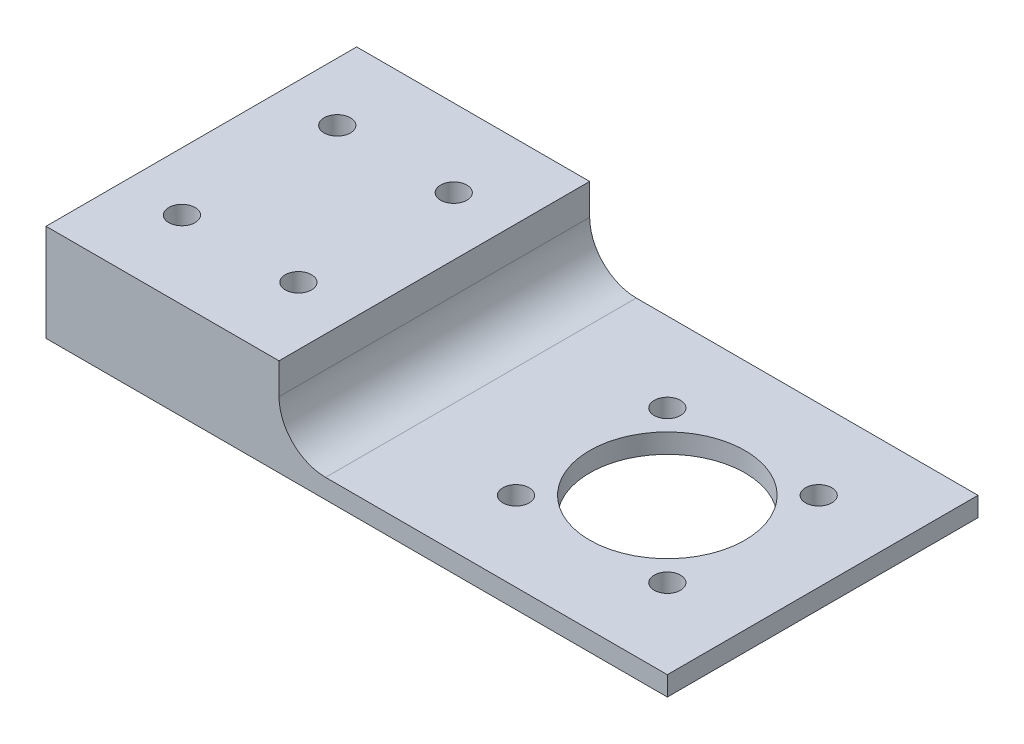
ISO-10303-21;
HEADER;
FILE_DESCRIPTION(('STEP AP214'),'2;1');
FILE_NAME('part.step','',(''),(''),'','','');
FILE_SCHEMA(('AUTOMOTIVE_DESIGN { 1 0 10303 214 1 1 1 1 }'));
ENDSEC;
DATA;
#1=APPLICATION_CONTEXT('core data for automotive mechanical design processes');
#2=APPLICATION_PROTOCOL_DEFINITION('international standard','automotive_design',2000,#1);
#3=PRODUCT_CONTEXT('',#1,'mechanical');
#4=PRODUCT('Part','Part','',(#3));
#5=PRODUCT_RELATED_PRODUCT_CATEGORY('part','',(#4));
#6=PRODUCT_DEFINITION_FORMATION('','',#4);
#7=PRODUCT_DEFINITION_CONTEXT('part definition',#1,'design');
#8=PRODUCT_DEFINITION('design','',#6,#7);
#9=PRODUCT_DEFINITION_SHAPE('','',#8);
#10=(LENGTH_UNIT() NAMED_UNIT(*) SI_UNIT(.MILLI.,.METRE.));
#11=(NAMED_UNIT(*) PLANE_ANGLE_UNIT() SI_UNIT($,.RADIAN.));
#12=(NAMED_UNIT(*) SI_UNIT($,.STERADIAN.) SOLID_ANGLE_UNIT());
#13=UNCERTAINTY_MEASURE_WITH_UNIT(LENGTH_MEASURE(1.E-05),#10,'distance_accuracy_value','');
#14=(GEOMETRIC_REPRESENTATION_CONTEXT(3) GLOBAL_UNCERTAINTY_ASSIGNED_CONTEXT((#13)) GLOBAL_UNIT_ASSIGNED_CONTEXT((#10,
#11,#12)) REPRESENTATION_CONTEXT('',''));
#15=CARTESIAN_POINT('',(0.,0.,0.));
#16=DIRECTION('',(0.,0.,1.));
#17=DIRECTION('',(1.,0.,0.));
#18=AXIS2_PLACEMENT_3D('',#15,#16,#17);
#19=CARTESIAN_POINT('',(0.,3.175,0.));
#20=DIRECTION('',(0.,-1.,0.));
#21=DIRECTION('',(0.,0.,-1.));
#22=AXIS2_PLACEMENT_3D('',#19,#20,#21);
#23=PLANE('',#22);
#24=CARTESIAN_POINT('',(38.1,3.175,0.));
#25=DIRECTION('',(0.,1.,0.));
#26=DIRECTION('',(0.,0.,1.));
#27=AXIS2_PLACEMENT_3D('',#24,#25,#26);
#28=CIRCLE('',#27,12.7);
#29=CARTESIAN_POINT('',(38.1,3.175,12.7));
#30=VERTEX_POINT('',#29);
#31=EDGE_CURVE('E318',#30,#30,#28,.T.);
#32=ORIENTED_EDGE('',*,*,#31,.F.);
#33=EDGE_LOOP('',(#32));
#34=FACE_BOUND('',#33,.T.);
#35=CARTESIAN_POINT('',(50.4743686707638,3.175,-12.3743686707636));
#36=DIRECTION('',(0.,1.,0.));
#37=DIRECTION('',(0.,0.,1.));
#38=AXIS2_PLACEMENT_3D('',#35,#36,#37);
#39=CIRCLE('',#38,2.15265);
#40=CARTESIAN_POINT('',(50.4743686707638,3.175,-10.2217186707636));
#41=VERTEX_POINT('',#40);
#42=EDGE_CURVE('E296',#41,#41,#39,.T.);
#43=ORIENTED_EDGE('',*,*,#42,.F.);
#44=EDGE_LOOP('',(#43));
#45=FACE_BOUND('',#44,.T.);
#46=CARTESIAN_POINT('',(25.7256313292346,3.175,12.3743686707654));
#47=DIRECTION('',(0.,1.,0.));
#48=DIRECTION('',(0.,0.,1.));
#49=AXIS2_PLACEMENT_3D('',#46,#47,#48);
#50=CIRCLE('',#49,2.15265);
#51=CARTESIAN_POINT('',(25.7256313292346,3.175,14.5270186707654));
#52=VERTEX_POINT('',#51);
#53=EDGE_CURVE('E291',#52,#52,#50,.T.);
#54=ORIENTED_EDGE('',*,*,#53,.F.);
#55=EDGE_LOOP('',(#54));
#56=FACE_BOUND('',#55,.T.);
#57=CARTESIAN_POINT('',(25.7256313292344,3.175,-12.3743686707635));
#58=DIRECTION('',(0.,1.,0.));
#59=DIRECTION('',(0.,0.,1.));
#60=AXIS2_PLACEMENT_3D('',#57,#58,#59);
#61=CIRCLE('',#60,2.15265);
#62=CARTESIAN_POINT('',(25.7256313292344,3.175,-10.2217186707635));
#63=VERTEX_POINT('',#62);
#64=EDGE_CURVE('E312',#63,#63,#61,.T.);
#65=ORIENTED_EDGE('',*,*,#64,.F.);
#66=EDGE_LOOP('',(#65));
#67=FACE_BOUND('',#66,.T.);
#68=CARTESIAN_POINT('',(50.4743686707642,3.175,12.374368670765));
#69=DIRECTION('',(0.,1.,0.));
#70=DIRECTION('',(0.,0.,1.));
#71=AXIS2_PLACEMENT_3D('',#68,#69,#70);
#72=CIRCLE('',#71,2.15265);
#73=CARTESIAN_POINT('',(50.4743686707642,3.175,14.527018670765));
#74=VERTEX_POINT('',#73);
#75=EDGE_CURVE('E120',#74,#74,#72,.T.);
#76=ORIENTED_EDGE('',*,*,#75,.F.);
#77=EDGE_LOOP('',(#76));
#78=FACE_BOUND('',#77,.T.);
#79=DIRECTION('',(-1.,0.,0.));
#80=VECTOR('',#79,1.);
#81=CARTESIAN_POINT('',(-38.1,3.175,-25.4));
#82=LINE('',#81,#80);
#83=CARTESIAN_POINT('',(63.5,3.175,-25.4));
#84=VERTEX_POINT('',#83);
#85=CARTESIAN_POINT('',(7.61999999999999,3.175,-25.4));
#86=VERTEX_POINT('',#85);
#87=EDGE_CURVE('E129',#84,#86,#82,.T.);
#88=ORIENTED_EDGE('',*,*,#87,.T.);
#89=DIRECTION('',(0.,0.,-1.));
#90=VECTOR('',#89,1.);
#91=CARTESIAN_POINT('',(7.62,3.175,25.4));
#92=LINE('',#91,#90);
#93=CARTESIAN_POINT('',(7.62,3.175,25.4));
#94=VERTEX_POINT('',#93);
#95=EDGE_CURVE('E55',#86,#94,#92,.F.);
#96=ORIENTED_EDGE('',*,*,#95,.T.);
#97=DIRECTION('',(1.,0.,0.));
#98=VECTOR('',#97,1.);
#99=CARTESIAN_POINT('',(-38.1,3.175,25.4));
#100=LINE('',#99,#98);
#101=CARTESIAN_POINT('',(63.5,3.175,25.4));
#102=VERTEX_POINT('',#101);
#103=EDGE_CURVE('E131',#94,#102,#100,.T.);
#104=ORIENTED_EDGE('',*,*,#103,.T.);
#105=DIRECTION('',(0.,0.,-1.));
#106=VECTOR('',#105,1.);
#107=CARTESIAN_POINT('',(63.5,3.175,-25.4));
#108=LINE('',#107,#106);
#109=EDGE_CURVE('E134',#102,#84,#108,.T.);
#110=ORIENTED_EDGE('',*,*,#109,.T.);
#111=EDGE_LOOP('',(#88,#96,#104,#110));
#112=FACE_BOUND('',#111,.T.);
#113=ADVANCED_FACE('F34',(#34,#45,#56,#67,#78,#112),#23,.F.);
#114=CARTESIAN_POINT('',(-38.1,3.175,-25.4));
#115=DIRECTION('',(1.,0.,0.));
#116=DIRECTION('',(0.,0.,-1.));
#117=AXIS2_PLACEMENT_3D('',#114,#115,#116);
#118=PLANE('',#117);
#119=DIRECTION('',(0.,0.,1.));
#120=VECTOR('',#119,1.);
#121=CARTESIAN_POINT('',(-38.1,0.,-25.4));
#122=LINE('',#121,#120);
#123=CARTESIAN_POINT('',(-38.1,0.,-25.4));
#124=VERTEX_POINT('',#123);
#125=CARTESIAN_POINT('',(-38.1,0.,25.4));
#126=VERTEX_POINT('',#125);
#127=EDGE_CURVE('E99',#124,#126,#122,.T.);
#128=ORIENTED_EDGE('',*,*,#127,.T.);
#129=DIRECTION('',(0.,-1.,0.));
#130=VECTOR('',#129,1.);
#131=CARTESIAN_POINT('',(-38.1,3.175,25.4));
#132=LINE('',#131,#130);
#133=CARTESIAN_POINT('',(-38.1,15.875,25.4));
#134=VERTEX_POINT('',#133);
#135=EDGE_CURVE('E92',#134,#126,#132,.T.);
#136=ORIENTED_EDGE('',*,*,#135,.F.);
#137=DIRECTION('',(0.,0.,1.));
#138=VECTOR('',#137,1.);
#139=CARTESIAN_POINT('',(-38.1,15.875,-25.4));
#140=LINE('',#139,#138);
#141=CARTESIAN_POINT('',(-38.1,15.875,-25.4));
#142=VERTEX_POINT('',#141);
#143=EDGE_CURVE('E97',#142,#134,#140,.T.);
#144=ORIENTED_EDGE('',*,*,#143,.F.);
#145=DIRECTION('',(0.,-1.,0.));
#146=VECTOR('',#145,1.);
#147=CARTESIAN_POINT('',(-38.1,3.175,-25.4));
#148=LINE('',#147,#146);
#149=EDGE_CURVE('E101',#142,#124,#148,.T.);
#150=ORIENTED_EDGE('',*,*,#149,.T.);
#151=EDGE_LOOP('',(#128,#136,#144,#150));
#152=FACE_BOUND('',#151,.T.);
#153=ADVANCED_FACE('F94',(#152),#118,.F.);
#154=CARTESIAN_POINT('',(63.5,3.175,25.4));
#155=DIRECTION('',(0.,0.,-1.));
#156=DIRECTION('',(-1.,0.,0.));
#157=AXIS2_PLACEMENT_3D('',#154,#155,#156);
#158=PLANE('',#157);
#159=DIRECTION('',(1.,0.,0.));
#160=VECTOR('',#159,1.);
#161=CARTESIAN_POINT('',(63.5,0.,25.4));
#162=LINE('',#161,#160);
#163=CARTESIAN_POINT('',(63.5,0.,25.4));
#164=VERTEX_POINT('',#163);
#165=EDGE_CURVE('E139',#126,#164,#162,.T.);
#166=ORIENTED_EDGE('',*,*,#165,.T.);
#167=DIRECTION('',(0.,-1.,0.));
#168=VECTOR('',#167,1.);
#169=CARTESIAN_POINT('',(63.5,3.175,25.4));
#170=LINE('',#169,#168);
#171=EDGE_CURVE('E102',#102,#164,#170,.T.);
#172=ORIENTED_EDGE('',*,*,#171,.F.);
#173=ORIENTED_EDGE('',*,*,#103,.F.);
#174=CARTESIAN_POINT('',(7.62,10.795,25.4));
#175=DIRECTION('',(0.,0.,-1.));
#176=DIRECTION('',(-1.,0.,0.));
#177=AXIS2_PLACEMENT_3D('',#174,#175,#176);
#178=CIRCLE('',#177,7.62);
#179=CARTESIAN_POINT('',(0.,10.795,25.4));
#180=VERTEX_POINT('',#179);
#181=EDGE_CURVE('E11',#94,#180,#178,.T.);
#182=ORIENTED_EDGE('',*,*,#181,.T.);
#183=DIRECTION('',(0.,-1.,0.));
#184=VECTOR('',#183,1.);
#185=CARTESIAN_POINT('',(0.,15.875,25.4));
#186=LINE('',#185,#184);
#187=CARTESIAN_POINT('',(0.,15.875,25.4));
#188=VERTEX_POINT('',#187);
#189=EDGE_CURVE('E108',#188,#180,#186,.T.);
#190=ORIENTED_EDGE('',*,*,#189,.F.);
#191=DIRECTION('',(1.,0.,0.));
#192=VECTOR('',#191,1.);
#193=CARTESIAN_POINT('',(-38.1,15.875,25.4));
#194=LINE('',#193,#192);
#195=EDGE_CURVE('E105',#134,#188,#194,.T.);
#196=ORIENTED_EDGE('',*,*,#195,.F.);
#197=ORIENTED_EDGE('',*,*,#135,.T.);
#198=EDGE_LOOP('',(#166,#172,#173,#182,#190,#196,#197));
#199=FACE_BOUND('',#198,.T.);
#200=ADVANCED_FACE('F106',(#199),#158,.F.);
#201=CARTESIAN_POINT('',(63.5,3.175,-25.4));
#202=DIRECTION('',(-1.,0.,0.));
#203=DIRECTION('',(0.,0.,1.));
#204=AXIS2_PLACEMENT_3D('',#201,#202,#203);
#205=PLANE('',#204);
#206=DIRECTION('',(0.,0.,-1.));
#207=VECTOR('',#206,1.);
#208=CARTESIAN_POINT('',(63.5,0.,-25.4));
#209=LINE('',#208,#207);
#210=CARTESIAN_POINT('',(63.5,0.,-25.4));
#211=VERTEX_POINT('',#210);
#212=EDGE_CURVE('E141',#164,#211,#209,.T.);
#213=ORIENTED_EDGE('',*,*,#212,.T.);
#214=DIRECTION('',(0.,-1.,0.));
#215=VECTOR('',#214,1.);
#216=CARTESIAN_POINT('',(63.5,3.175,-25.4));
#217=LINE('',#216,#215);
#218=EDGE_CURVE('E137',#84,#211,#217,.T.);
#219=ORIENTED_EDGE('',*,*,#218,.F.);
#220=ORIENTED_EDGE('',*,*,#109,.F.);
#221=ORIENTED_EDGE('',*,*,#171,.T.);
#222=EDGE_LOOP('',(#213,#219,#220,#221));
#223=FACE_BOUND('',#222,.T.);
#224=ADVANCED_FACE('F167',(#223),#205,.F.);
#225=CARTESIAN_POINT('',(50.8,3.175,-25.4));
#226=DIRECTION('',(0.,0.,1.));
#227=DIRECTION('',(1.,0.,0.));
#228=AXIS2_PLACEMENT_3D('',#225,#226,#227);
#229=PLANE('',#228);
#230=DIRECTION('',(-1.,0.,0.));
#231=VECTOR('',#230,1.);
#232=CARTESIAN_POINT('',(50.8,0.,-25.4));
#233=LINE('',#232,#231);
#234=EDGE_CURVE('E132',#211,#124,#233,.T.);
#235=ORIENTED_EDGE('',*,*,#234,.T.);
#236=ORIENTED_EDGE('',*,*,#149,.F.);
#237=DIRECTION('',(-1.,0.,0.));
#238=VECTOR('',#237,1.);
#239=CARTESIAN_POINT('',(-38.1,15.875,-25.4));
#240=LINE('',#239,#238);
#241=CARTESIAN_POINT('',(0.,15.875,-25.4));
#242=VERTEX_POINT('',#241);
#243=EDGE_CURVE('E116',#242,#142,#240,.T.);
#244=ORIENTED_EDGE('',*,*,#243,.F.);
#245=DIRECTION('',(0.,-1.,0.));
#246=VECTOR('',#245,1.);
#247=CARTESIAN_POINT('',(0.,15.875,-25.4));
#248=LINE('',#247,#246);
#249=CARTESIAN_POINT('',(0.,10.795,-25.4));
#250=VERTEX_POINT('',#249);
#251=EDGE_CURVE('E126',#242,#250,#248,.T.);
#252=ORIENTED_EDGE('',*,*,#251,.T.);
#253=CARTESIAN_POINT('',(7.62,10.795,-25.4));
#254=DIRECTION('',(0.,0.,1.));
#255=DIRECTION('',(1.,0.,0.));
#256=AXIS2_PLACEMENT_3D('',#253,#254,#255);
#257=CIRCLE('',#256,7.62);
#258=EDGE_CURVE('E42',#250,#86,#257,.T.);
#259=ORIENTED_EDGE('',*,*,#258,.T.);
#260=ORIENTED_EDGE('',*,*,#87,.F.);
#261=ORIENTED_EDGE('',*,*,#218,.T.);
#262=EDGE_LOOP('',(#235,#236,#244,#252,#259,#260,#261));
#263=FACE_BOUND('',#262,.T.);
#264=ADVANCED_FACE('F159',(#263),#229,.F.);
#265=CARTESIAN_POINT('',(0.,0.,0.));
#266=DIRECTION('',(0.,-1.,0.));
#267=DIRECTION('',(0.,0.,-1.));
#268=AXIS2_PLACEMENT_3D('',#265,#266,#267);
#269=PLANE('',#268);
#270=CARTESIAN_POINT('',(-28.575,0.,-12.7));
#271=DIRECTION('',(0.,-1.,0.));
#272=DIRECTION('',(0.,0.,1.));
#273=AXIS2_PLACEMENT_3D('',#270,#271,#272);
#274=CIRCLE('',#273,2.15265);
#275=CARTESIAN_POINT('',(-28.575,0.,-10.54735));
#276=VERTEX_POINT('',#275);
#277=EDGE_CURVE('E331',#276,#276,#274,.T.);
#278=ORIENTED_EDGE('',*,*,#277,.F.);
#279=EDGE_LOOP('',(#278));
#280=FACE_BOUND('',#279,.T.);
#281=CARTESIAN_POINT('',(-9.525,0.,12.7));
#282=DIRECTION('',(0.,-1.,0.));
#283=DIRECTION('',(0.,0.,-1.));
#284=AXIS2_PLACEMENT_3D('',#281,#282,#283);
#285=CIRCLE('',#284,2.15265);
#286=CARTESIAN_POINT('',(-9.525,0.,10.54735));
#287=VERTEX_POINT('',#286);
#288=EDGE_CURVE('E332',#287,#287,#285,.T.);
#289=ORIENTED_EDGE('',*,*,#288,.F.);
#290=EDGE_LOOP('',(#289));
#291=FACE_BOUND('',#290,.T.);
#292=CARTESIAN_POINT('',(-28.575,0.,12.7));
#293=DIRECTION('',(0.,-1.,0.));
#294=DIRECTION('',(0.,0.,-1.));
#295=AXIS2_PLACEMENT_3D('',#292,#293,#294);
#296=CIRCLE('',#295,2.15265);
#297=CARTESIAN_POINT('',(-28.575,0.,10.54735));
#298=VERTEX_POINT('',#297);
#299=EDGE_CURVE('E341',#298,#298,#296,.T.);
#300=ORIENTED_EDGE('',*,*,#299,.F.);
#301=EDGE_LOOP('',(#300));
#302=FACE_BOUND('',#301,.T.);
#303=CARTESIAN_POINT('',(-9.525,0.,-12.7));
#304=DIRECTION('',(0.,-1.,0.));
#305=DIRECTION('',(0.,0.,1.));
#306=AXIS2_PLACEMENT_3D('',#303,#304,#305);
#307=CIRCLE('',#306,2.15265);
#308=CARTESIAN_POINT('',(-9.525,0.,-10.54735));
#309=VERTEX_POINT('',#308);
#310=EDGE_CURVE('E324',#309,#309,#307,.T.);
#311=ORIENTED_EDGE('',*,*,#310,.F.);
#312=EDGE_LOOP('',(#311));
#313=FACE_BOUND('',#312,.T.);
#314=CARTESIAN_POINT('',(38.1,0.,0.));
#315=DIRECTION('',(0.,-1.,0.));
#316=DIRECTION('',(0.,0.,-1.));
#317=AXIS2_PLACEMENT_3D('',#314,#315,#316);
#318=CIRCLE('',#317,12.7);
#319=CARTESIAN_POINT('',(38.1,0.,-12.7));
#320=VERTEX_POINT('',#319);
#321=EDGE_CURVE('E315',#320,#320,#318,.F.);
#322=ORIENTED_EDGE('',*,*,#321,.T.);
#323=EDGE_LOOP('',(#322));
#324=FACE_BOUND('',#323,.T.);
#325=CARTESIAN_POINT('',(50.4743686707638,0.,-12.3743686707636));
#326=DIRECTION('',(0.,-1.,0.));
#327=DIRECTION('',(0.,0.,-1.));
#328=AXIS2_PLACEMENT_3D('',#325,#326,#327);
#329=CIRCLE('',#328,2.15265);
#330=CARTESIAN_POINT('',(50.4743686707638,0.,-14.5270186707636));
#331=VERTEX_POINT('',#330);
#332=EDGE_CURVE('E299',#331,#331,#329,.F.);
#333=ORIENTED_EDGE('',*,*,#332,.T.);
#334=EDGE_LOOP('',(#333));
#335=FACE_BOUND('',#334,.T.);
#336=CARTESIAN_POINT('',(25.7256313292346,0.,12.3743686707654));
#337=DIRECTION('',(0.,-1.,0.));
#338=DIRECTION('',(0.,0.,-1.));
#339=AXIS2_PLACEMENT_3D('',#336,#337,#338);
#340=CIRCLE('',#339,2.15265);
#341=CARTESIAN_POINT('',(25.7256313292346,0.,10.2217186707654));
#342=VERTEX_POINT('',#341);
#343=EDGE_CURVE('E294',#342,#342,#340,.F.);
#344=ORIENTED_EDGE('',*,*,#343,.T.);
#345=EDGE_LOOP('',(#344));
#346=FACE_BOUND('',#345,.T.);
#347=CARTESIAN_POINT('',(25.7256313292344,0.,-12.3743686707635));
#348=DIRECTION('',(0.,-1.,0.));
#349=DIRECTION('',(0.,0.,-1.));
#350=AXIS2_PLACEMENT_3D('',#347,#348,#349);
#351=CIRCLE('',#350,2.15265);
#352=CARTESIAN_POINT('',(25.7256313292344,0.,-14.5270186707635));
#353=VERTEX_POINT('',#352);
#354=EDGE_CURVE('E301',#353,#353,#351,.F.);
#355=ORIENTED_EDGE('',*,*,#354,.T.);
#356=EDGE_LOOP('',(#355));
#357=FACE_BOUND('',#356,.T.);
#358=CARTESIAN_POINT('',(50.4743686707642,0.,12.374368670765));
#359=DIRECTION('',(0.,-1.,0.));
#360=DIRECTION('',(0.,0.,-1.));
#361=AXIS2_PLACEMENT_3D('',#358,#359,#360);
#362=CIRCLE('',#361,2.15265);
#363=CARTESIAN_POINT('',(50.4743686707642,0.,10.221718670765));
#364=VERTEX_POINT('',#363);
#365=EDGE_CURVE('E117',#364,#364,#362,.F.);
#366=ORIENTED_EDGE('',*,*,#365,.T.);
#367=EDGE_LOOP('',(#366));
#368=FACE_BOUND('',#367,.T.);
#369=ORIENTED_EDGE('',*,*,#127,.F.);
#370=ORIENTED_EDGE('',*,*,#234,.F.);
#371=ORIENTED_EDGE('',*,*,#212,.F.);
#372=ORIENTED_EDGE('',*,*,#165,.F.);
#373=EDGE_LOOP('',(#369,#370,#371,#372));
#374=FACE_BOUND('',#373,.T.);
#375=ADVANCED_FACE('F163',(#280,#291,#302,#313,#324,#335,#346,#357,#368,#374),#269,.T.);
#376=CARTESIAN_POINT('',(0.,15.875,-25.4));
#377=DIRECTION('',(-1.,0.,0.));
#378=DIRECTION('',(0.,0.,1.));
#379=AXIS2_PLACEMENT_3D('',#376,#377,#378);
#380=PLANE('',#379);
#381=ORIENTED_EDGE('',*,*,#189,.T.);
#382=DIRECTION('',(0.,0.,-1.));
#383=VECTOR('',#382,1.);
#384=CARTESIAN_POINT('',(0.,10.795,-25.4));
#385=LINE('',#384,#383);
#386=EDGE_CURVE('E150',#180,#250,#385,.T.);
#387=ORIENTED_EDGE('',*,*,#386,.T.);
#388=ORIENTED_EDGE('',*,*,#251,.F.);
#389=DIRECTION('',(0.,0.,-1.));
#390=VECTOR('',#389,1.);
#391=CARTESIAN_POINT('',(0.,15.875,-25.4));
#392=LINE('',#391,#390);
#393=EDGE_CURVE('E111',#188,#242,#392,.T.);
#394=ORIENTED_EDGE('',*,*,#393,.F.);
#395=EDGE_LOOP('',(#381,#387,#388,#394));
#396=FACE_BOUND('',#395,.T.);
#397=ADVANCED_FACE('F156',(#396),#380,.F.);
#398=CARTESIAN_POINT('',(0.,15.875,0.));
#399=DIRECTION('',(0.,1.,0.));
#400=DIRECTION('',(0.,0.,1.));
#401=AXIS2_PLACEMENT_3D('',#398,#399,#400);
#402=PLANE('',#401);
#403=CARTESIAN_POINT('',(-28.575,15.875,-12.7));
#404=DIRECTION('',(0.,1.,0.));
#405=DIRECTION('',(0.,0.,1.));
#406=AXIS2_PLACEMENT_3D('',#403,#404,#405);
#407=CIRCLE('',#406,2.15265);
#408=CARTESIAN_POINT('',(-28.575,15.875,-10.54735));
#409=VERTEX_POINT('',#408);
#410=EDGE_CURVE('E327',#409,#409,#407,.F.);
#411=ORIENTED_EDGE('',*,*,#410,.T.);
#412=EDGE_LOOP('',(#411));
#413=FACE_BOUND('',#412,.T.);
#414=CARTESIAN_POINT('',(-9.525,15.875,12.7));
#415=DIRECTION('',(0.,1.,0.));
#416=DIRECTION('',(0.,0.,1.));
#417=AXIS2_PLACEMENT_3D('',#414,#415,#416);
#418=CIRCLE('',#417,2.15265);
#419=CARTESIAN_POINT('',(-9.525,15.875,14.85265));
#420=VERTEX_POINT('',#419);
#421=EDGE_CURVE('E328',#420,#420,#418,.F.);
#422=ORIENTED_EDGE('',*,*,#421,.T.);
#423=EDGE_LOOP('',(#422));
#424=FACE_BOUND('',#423,.T.);
#425=CARTESIAN_POINT('',(-28.575,15.875,12.7));
#426=DIRECTION('',(0.,1.,0.));
#427=DIRECTION('',(0.,0.,1.));
#428=AXIS2_PLACEMENT_3D('',#425,#426,#427);
#429=CIRCLE('',#428,2.15265);
#430=CARTESIAN_POINT('',(-28.575,15.875,14.85265));
#431=VERTEX_POINT('',#430);
#432=EDGE_CURVE('E335',#431,#431,#429,.F.);
#433=ORIENTED_EDGE('',*,*,#432,.T.);
#434=EDGE_LOOP('',(#433));
#435=FACE_BOUND('',#434,.T.);
#436=CARTESIAN_POINT('',(-9.525,15.875,-12.7));
#437=DIRECTION('',(0.,1.,0.));
#438=DIRECTION('',(0.,0.,1.));
#439=AXIS2_PLACEMENT_3D('',#436,#437,#438);
#440=CIRCLE('',#439,2.15265);
#441=CARTESIAN_POINT('',(-9.525,15.875,-10.54735));
#442=VERTEX_POINT('',#441);
#443=EDGE_CURVE('E321',#442,#442,#440,.F.);
#444=ORIENTED_EDGE('',*,*,#443,.T.);
#445=EDGE_LOOP('',(#444));
#446=FACE_BOUND('',#445,.T.);
#447=ORIENTED_EDGE('',*,*,#143,.T.);
#448=ORIENTED_EDGE('',*,*,#195,.T.);
#449=ORIENTED_EDGE('',*,*,#393,.T.);
#450=ORIENTED_EDGE('',*,*,#243,.T.);
#451=EDGE_LOOP('',(#447,#448,#449,#450));
#452=FACE_BOUND('',#451,.T.);
#453=ADVANCED_FACE('F114',(#413,#424,#435,#446,#452),#402,.T.);
#454=CARTESIAN_POINT('',(7.62,10.795,-25.4));
#455=DIRECTION('',(0.,0.,1.));
#456=DIRECTION('',(1.,0.,0.));
#457=AXIS2_PLACEMENT_3D('',#454,#455,#456);
#458=CYLINDRICAL_SURFACE('',#457,7.62);
#459=ORIENTED_EDGE('',*,*,#181,.F.);
#460=ORIENTED_EDGE('',*,*,#95,.F.);
#461=ORIENTED_EDGE('',*,*,#258,.F.);
#462=ORIENTED_EDGE('',*,*,#386,.F.);
#463=EDGE_LOOP('',(#459,#460,#461,#462));
#464=FACE_BOUND('',#463,.T.);
#465=ADVANCED_FACE('F36',(#464),#458,.F.);
#466=CARTESIAN_POINT('',(50.4743686707642,-6.08861365008489,12.374368670765));
#467=DIRECTION('',(0.,1.,0.));
#468=DIRECTION('',(0.,0.,1.));
#469=AXIS2_PLACEMENT_3D('',#466,#467,#468);
#470=CYLINDRICAL_SURFACE('',#469,2.15265);
#471=ORIENTED_EDGE('',*,*,#75,.T.);
#472=EDGE_LOOP('',(#471));
#473=FACE_BOUND('',#472,.T.);
#474=ORIENTED_EDGE('',*,*,#365,.F.);
#475=EDGE_LOOP('',(#474));
#476=FACE_BOUND('',#475,.T.);
#477=ADVANCED_FACE('F169',(#473,#476),#470,.F.);
#478=CARTESIAN_POINT('',(25.7256313292344,-6.08861365008489,-12.3743686707635));
#479=DIRECTION('',(0.,1.,0.));
#480=DIRECTION('',(0.,0.,1.));
#481=AXIS2_PLACEMENT_3D('',#478,#479,#480);
#482=CYLINDRICAL_SURFACE('',#481,2.15265);
#483=ORIENTED_EDGE('',*,*,#64,.T.);
#484=EDGE_LOOP('',(#483));
#485=FACE_BOUND('',#484,.T.);
#486=ORIENTED_EDGE('',*,*,#354,.F.);
#487=EDGE_LOOP('',(#486));
#488=FACE_BOUND('',#487,.T.);
#489=ADVANCED_FACE('F174',(#485,#488),#482,.F.);
#490=CARTESIAN_POINT('',(25.7256313292346,-6.08861365008489,12.3743686707654));
#491=DIRECTION('',(0.,1.,0.));
#492=DIRECTION('',(0.,0.,1.));
#493=AXIS2_PLACEMENT_3D('',#490,#491,#492);
#494=CYLINDRICAL_SURFACE('',#493,2.15265);
#495=ORIENTED_EDGE('',*,*,#53,.T.);
#496=EDGE_LOOP('',(#495));
#497=FACE_BOUND('',#496,.T.);
#498=ORIENTED_EDGE('',*,*,#343,.F.);
#499=EDGE_LOOP('',(#498));
#500=FACE_BOUND('',#499,.T.);
#501=ADVANCED_FACE('F279',(#497,#500),#494,.F.);
#502=CARTESIAN_POINT('',(50.4743686707638,-6.08861365008489,-12.3743686707636));
#503=DIRECTION('',(0.,1.,0.));
#504=DIRECTION('',(0.,0.,1.));
#505=AXIS2_PLACEMENT_3D('',#502,#503,#504);
#506=CYLINDRICAL_SURFACE('',#505,2.15265);
#507=ORIENTED_EDGE('',*,*,#42,.T.);
#508=EDGE_LOOP('',(#507));
#509=FACE_BOUND('',#508,.T.);
#510=ORIENTED_EDGE('',*,*,#332,.F.);
#511=EDGE_LOOP('',(#510));
#512=FACE_BOUND('',#511,.T.);
#513=ADVANCED_FACE('F275',(#509,#512),#506,.F.);
#514=CARTESIAN_POINT('',(38.1,-35.9210244842766,0.));
#515=DIRECTION('',(0.,1.,0.));
#516=DIRECTION('',(0.,0.,1.));
#517=AXIS2_PLACEMENT_3D('',#514,#515,#516);
#518=CYLINDRICAL_SURFACE('',#517,12.7);
#519=ORIENTED_EDGE('',*,*,#31,.T.);
#520=EDGE_LOOP('',(#519));
#521=FACE_BOUND('',#520,.T.);
#522=ORIENTED_EDGE('',*,*,#321,.F.);
#523=EDGE_LOOP('',(#522));
#524=FACE_BOUND('',#523,.T.);
#525=ADVANCED_FACE('F235',(#521,#524),#518,.F.);
#526=CARTESIAN_POINT('',(-9.525,21.9636136500849,-12.7));
#527=DIRECTION('',(0.,-1.,0.));
#528=DIRECTION('',(0.,0.,-1.));
#529=AXIS2_PLACEMENT_3D('',#526,#527,#528);
#530=CYLINDRICAL_SURFACE('',#529,2.15265);
#531=ORIENTED_EDGE('',*,*,#310,.T.);
#532=EDGE_LOOP('',(#531));
#533=FACE_BOUND('',#532,.T.);
#534=ORIENTED_EDGE('',*,*,#443,.F.);
#535=EDGE_LOOP('',(#534));
#536=FACE_BOUND('',#535,.T.);
#537=ADVANCED_FACE('F229',(#533,#536),#530,.F.);
#538=CARTESIAN_POINT('',(-28.575,21.9636136500849,12.7));
#539=DIRECTION('',(0.,-1.,0.));
#540=DIRECTION('',(0.,0.,-1.));
#541=AXIS2_PLACEMENT_3D('',#538,#539,#540);
#542=CYLINDRICAL_SURFACE('',#541,2.15265);
#543=ORIENTED_EDGE('',*,*,#299,.T.);
#544=EDGE_LOOP('',(#543));
#545=FACE_BOUND('',#544,.T.);
#546=ORIENTED_EDGE('',*,*,#432,.F.);
#547=EDGE_LOOP('',(#546));
#548=FACE_BOUND('',#547,.T.);
#549=ADVANCED_FACE('F234',(#545,#548),#542,.F.);
#550=CARTESIAN_POINT('',(-9.525,21.9636136500849,12.7));
#551=DIRECTION('',(0.,-1.,0.));
#552=DIRECTION('',(0.,0.,-1.));
#553=AXIS2_PLACEMENT_3D('',#550,#551,#552);
#554=CYLINDRICAL_SURFACE('',#553,2.15265);
#555=ORIENTED_EDGE('',*,*,#288,.T.);
#556=EDGE_LOOP('',(#555));
#557=FACE_BOUND('',#556,.T.);
#558=ORIENTED_EDGE('',*,*,#421,.F.);
#559=EDGE_LOOP('',(#558));
#560=FACE_BOUND('',#559,.T.);
#561=ADVANCED_FACE('F247',(#557,#560),#554,.F.);
#562=CARTESIAN_POINT('',(-28.575,21.9636136500849,-12.7));
#563=DIRECTION('',(0.,-1.,0.));
#564=DIRECTION('',(0.,0.,-1.));
#565=AXIS2_PLACEMENT_3D('',#562,#563,#564);
#566=CYLINDRICAL_SURFACE('',#565,2.15265);
#567=ORIENTED_EDGE('',*,*,#277,.T.);
#568=EDGE_LOOP('',(#567));
#569=FACE_BOUND('',#568,.T.);
#570=ORIENTED_EDGE('',*,*,#410,.F.);
#571=EDGE_LOOP('',(#570));
#572=FACE_BOUND('',#571,.T.);
#573=ADVANCED_FACE('F257',(#569,#572),#566,.F.);
#574=CLOSED_SHELL('',(#113,#153,#200,#224,#264,#375,#397,#453,#465,#477,#489,#501,#513,#525,
#537,#549,#561,#573));
#575=MANIFOLD_SOLID_BREP('B2',#574);
#576=ADVANCED_BREP_SHAPE_REPRESENTATION('',(#18,#575),#14);
#577=SHAPE_DEFINITION_REPRESENTATION(#9,#576);
ENDSEC;
END-ISO-10303-21;
